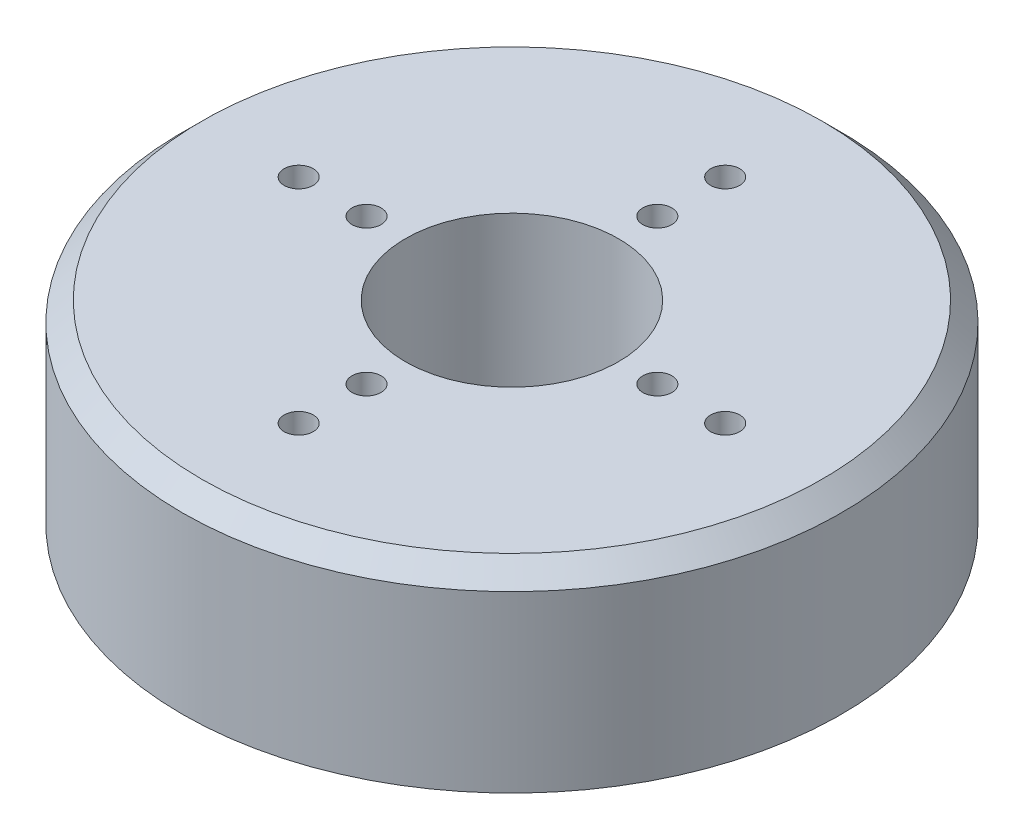
ISO-10303-21;
HEADER;
FILE_DESCRIPTION(('STEP AP214'),'2;1');
FILE_NAME('part.step','',(''),(''),'','','');
FILE_SCHEMA(('AUTOMOTIVE_DESIGN { 1 0 10303 214 1 1 1 1 }'));
ENDSEC;
DATA;
#1=APPLICATION_CONTEXT('core data for automotive mechanical design processes');
#2=APPLICATION_PROTOCOL_DEFINITION('international standard','automotive_design',2000,#1);
#3=PRODUCT_CONTEXT('',#1,'mechanical');
#4=PRODUCT('Part','Part','',(#3));
#5=PRODUCT_RELATED_PRODUCT_CATEGORY('part','',(#4));
#6=PRODUCT_DEFINITION_FORMATION('','',#4);
#7=PRODUCT_DEFINITION_CONTEXT('part definition',#1,'design');
#8=PRODUCT_DEFINITION('design','',#6,#7);
#9=PRODUCT_DEFINITION_SHAPE('','',#8);
#10=(LENGTH_UNIT() NAMED_UNIT(*) SI_UNIT(.MILLI.,.METRE.));
#11=(NAMED_UNIT(*) PLANE_ANGLE_UNIT() SI_UNIT($,.RADIAN.));
#12=(NAMED_UNIT(*) SI_UNIT($,.STERADIAN.) SOLID_ANGLE_UNIT());
#13=UNCERTAINTY_MEASURE_WITH_UNIT(LENGTH_MEASURE(1.E-05),#10,'distance_accuracy_value','');
#14=(GEOMETRIC_REPRESENTATION_CONTEXT(3) GLOBAL_UNCERTAINTY_ASSIGNED_CONTEXT((#13)) GLOBAL_UNIT_ASSIGNED_CONTEXT((#10,
#11,#12)) REPRESENTATION_CONTEXT('',''));
#15=CARTESIAN_POINT('',(0.,0.,0.));
#16=DIRECTION('',(0.,0.,1.));
#17=DIRECTION('',(1.,0.,0.));
#18=AXIS2_PLACEMENT_3D('',#15,#16,#17);
#19=CARTESIAN_POINT('',(0.,20.,0.));
#20=DIRECTION('',(0.,-1.,0.));
#21=DIRECTION('',(0.,0.,-1.));
#22=AXIS2_PLACEMENT_3D('',#19,#20,#21);
#23=CYLINDRICAL_SURFACE('',#22,30.);
#24=CARTESIAN_POINT('',(0.,16.,0.));
#25=DIRECTION('',(0.,1.,0.));
#26=DIRECTION('',(0.,0.,1.));
#27=AXIS2_PLACEMENT_3D('',#24,#25,#26);
#28=CIRCLE('',#27,30.);
#29=CARTESIAN_POINT('',(0.,16.,30.));
#30=VERTEX_POINT('',#29);
#31=EDGE_CURVE('E63',#30,#30,#28,.T.);
#32=ORIENTED_EDGE('',*,*,#31,.T.);
#33=EDGE_LOOP('',(#32));
#34=FACE_BOUND('',#33,.T.);
#35=CARTESIAN_POINT('',(0.,13.,0.));
#36=DIRECTION('',(0.,-1.,0.));
#37=DIRECTION('',(0.,0.,-1.));
#38=AXIS2_PLACEMENT_3D('',#35,#36,#37);
#39=CIRCLE('',#38,30.);
#40=CARTESIAN_POINT('',(0.,13.,-30.));
#41=VERTEX_POINT('',#40);
#42=EDGE_CURVE('E129',#41,#41,#39,.T.);
#43=ORIENTED_EDGE('',*,*,#42,.T.);
#44=EDGE_LOOP('',(#43));
#45=FACE_BOUND('',#44,.T.);
#46=ADVANCED_FACE('F36',(#34,#45),#23,.F.);
#47=CARTESIAN_POINT('',(0.,-35.3553390593274,0.));
#48=DIRECTION('',(0.,1.,0.));
#49=DIRECTION('',(0.,0.,1.));
#50=AXIS2_PLACEMENT_3D('',#47,#48,#49);
#51=CYLINDRICAL_SURFACE('',#50,12.5);
#52=CARTESIAN_POINT('',(0.,16.,0.));
#53=DIRECTION('',(0.,1.,0.));
#54=DIRECTION('',(0.,0.,1.));
#55=AXIS2_PLACEMENT_3D('',#52,#53,#54);
#56=CIRCLE('',#55,12.5);
#57=CARTESIAN_POINT('',(0.,16.,12.5));
#58=VERTEX_POINT('',#57);
#59=EDGE_CURVE('E47',#58,#58,#56,.F.);
#60=ORIENTED_EDGE('',*,*,#59,.T.);
#61=EDGE_LOOP('',(#60));
#62=FACE_BOUND('',#61,.T.);
#63=CARTESIAN_POINT('',(0.,13.,0.));
#64=DIRECTION('',(0.,-1.,0.));
#65=DIRECTION('',(0.,0.,-1.));
#66=AXIS2_PLACEMENT_3D('',#63,#64,#65);
#67=CIRCLE('',#66,12.5);
#68=CARTESIAN_POINT('',(0.,13.,-12.5));
#69=VERTEX_POINT('',#68);
#70=EDGE_CURVE('E43',#69,#69,#67,.T.);
#71=ORIENTED_EDGE('',*,*,#70,.F.);
#72=EDGE_LOOP('',(#71));
#73=FACE_BOUND('',#72,.T.);
#74=ADVANCED_FACE('F152',(#62,#73),#51,.T.);
#75=CARTESIAN_POINT('',(0.,16.,0.));
#76=DIRECTION('',(0.,1.,0.));
#77=DIRECTION('',(0.,0.,1.));
#78=AXIS2_PLACEMENT_3D('',#75,#76,#77);
#79=PLANE('',#78);
#80=ORIENTED_EDGE('',*,*,#31,.F.);
#81=EDGE_LOOP('',(#80));
#82=FACE_BOUND('',#81,.T.);
#83=CARTESIAN_POINT('',(-22.,16.,0.));
#84=DIRECTION('',(0.,1.,0.));
#85=DIRECTION('',(0.,0.,1.));
#86=AXIS2_PLACEMENT_3D('',#83,#84,#85);
#87=CIRCLE('',#86,1.5);
#88=CARTESIAN_POINT('',(-22.,16.,1.50000000000001));
#89=VERTEX_POINT('',#88);
#90=EDGE_CURVE('E82',#89,#89,#87,.T.);
#91=ORIENTED_EDGE('',*,*,#90,.T.);
#92=EDGE_LOOP('',(#91));
#93=FACE_BOUND('',#92,.T.);
#94=CARTESIAN_POINT('',(-15.,16.,0.));
#95=DIRECTION('',(0.,1.,0.));
#96=DIRECTION('',(0.,0.,1.));
#97=AXIS2_PLACEMENT_3D('',#94,#95,#96);
#98=CIRCLE('',#97,1.5);
#99=CARTESIAN_POINT('',(-15.,16.,1.5));
#100=VERTEX_POINT('',#99);
#101=EDGE_CURVE('E79',#100,#100,#98,.T.);
#102=ORIENTED_EDGE('',*,*,#101,.T.);
#103=EDGE_LOOP('',(#102));
#104=FACE_BOUND('',#103,.T.);
#105=CARTESIAN_POINT('',(0.,16.,22.));
#106=DIRECTION('',(0.,1.,0.));
#107=DIRECTION('',(0.,0.,1.));
#108=AXIS2_PLACEMENT_3D('',#105,#106,#107);
#109=CIRCLE('',#108,1.5);
#110=CARTESIAN_POINT('',(0.,16.,23.5));
#111=VERTEX_POINT('',#110);
#112=EDGE_CURVE('E76',#111,#111,#109,.T.);
#113=ORIENTED_EDGE('',*,*,#112,.T.);
#114=EDGE_LOOP('',(#113));
#115=FACE_BOUND('',#114,.T.);
#116=CARTESIAN_POINT('',(0.,16.,15.));
#117=DIRECTION('',(0.,1.,0.));
#118=DIRECTION('',(0.,0.,1.));
#119=AXIS2_PLACEMENT_3D('',#116,#117,#118);
#120=CIRCLE('',#119,1.5);
#121=CARTESIAN_POINT('',(0.,16.,16.5));
#122=VERTEX_POINT('',#121);
#123=EDGE_CURVE('E73',#122,#122,#120,.T.);
#124=ORIENTED_EDGE('',*,*,#123,.T.);
#125=EDGE_LOOP('',(#124));
#126=FACE_BOUND('',#125,.T.);
#127=CARTESIAN_POINT('',(22.,16.,0.));
#128=DIRECTION('',(0.,1.,0.));
#129=DIRECTION('',(0.,0.,1.));
#130=AXIS2_PLACEMENT_3D('',#127,#128,#129);
#131=CIRCLE('',#130,1.5);
#132=CARTESIAN_POINT('',(22.,16.,1.5));
#133=VERTEX_POINT('',#132);
#134=EDGE_CURVE('E70',#133,#133,#131,.T.);
#135=ORIENTED_EDGE('',*,*,#134,.T.);
#136=EDGE_LOOP('',(#135));
#137=FACE_BOUND('',#136,.T.);
#138=CARTESIAN_POINT('',(15.,16.,0.));
#139=DIRECTION('',(0.,1.,0.));
#140=DIRECTION('',(0.,0.,1.));
#141=AXIS2_PLACEMENT_3D('',#138,#139,#140);
#142=CIRCLE('',#141,1.5);
#143=CARTESIAN_POINT('',(15.,16.,1.5));
#144=VERTEX_POINT('',#143);
#145=EDGE_CURVE('E67',#144,#144,#142,.T.);
#146=ORIENTED_EDGE('',*,*,#145,.T.);
#147=EDGE_LOOP('',(#146));
#148=FACE_BOUND('',#147,.T.);
#149=CARTESIAN_POINT('',(0.,16.,-22.));
#150=DIRECTION('',(0.,1.,0.));
#151=DIRECTION('',(0.,0.,1.));
#152=AXIS2_PLACEMENT_3D('',#149,#150,#151);
#153=CIRCLE('',#152,1.5);
#154=CARTESIAN_POINT('',(0.,16.,-20.5));
#155=VERTEX_POINT('',#154);
#156=EDGE_CURVE('E64',#155,#155,#153,.T.);
#157=ORIENTED_EDGE('',*,*,#156,.T.);
#158=EDGE_LOOP('',(#157));
#159=FACE_BOUND('',#158,.T.);
#160=CARTESIAN_POINT('',(0.,16.,-15.));
#161=DIRECTION('',(0.,1.,0.));
#162=DIRECTION('',(0.,0.,1.));
#163=AXIS2_PLACEMENT_3D('',#160,#161,#162);
#164=CIRCLE('',#163,1.5);
#165=CARTESIAN_POINT('',(0.,16.,-13.5));
#166=VERTEX_POINT('',#165);
#167=EDGE_CURVE('E60',#166,#166,#164,.T.);
#168=ORIENTED_EDGE('',*,*,#167,.T.);
#169=EDGE_LOOP('',(#168));
#170=FACE_BOUND('',#169,.T.);
#171=ORIENTED_EDGE('',*,*,#59,.F.);
#172=EDGE_LOOP('',(#171));
#173=FACE_BOUND('',#172,.T.);
#174=ADVANCED_FACE('F159',(#82,#93,#104,#115,#126,#137,#148,#159,#170,#173),#79,.F.);
#175=CARTESIAN_POINT('',(0.,10.,0.));
#176=DIRECTION('',(0.,-1.,0.));
#177=DIRECTION('',(0.,0.,-1.));
#178=AXIS2_PLACEMENT_3D('',#175,#176,#177);
#179=CIRCLE('',#178,30.);
#180=CARTESIAN_POINT('',(0.,10.,-30.));
#181=VERTEX_POINT('',#180);
#182=EDGE_CURVE('E10',#181,#181,#179,.T.);
#183=ORIENTED_EDGE('',*,*,#182,.F.);
#184=EDGE_LOOP('',(#183));
#185=FACE_BOUND('',#184,.T.);
#186=CARTESIAN_POINT('',(0.,0.,0.));
#187=DIRECTION('',(0.,1.,0.));
#188=DIRECTION('',(0.,0.,1.));
#189=AXIS2_PLACEMENT_3D('',#186,#187,#188);
#190=CIRCLE('',#189,30.);
#191=CARTESIAN_POINT('',(0.,0.,30.));
#192=VERTEX_POINT('',#191);
#193=EDGE_CURVE('E88',#192,#192,#190,.T.);
#194=ORIENTED_EDGE('',*,*,#193,.F.);
#195=EDGE_LOOP('',(#194));
#196=FACE_BOUND('',#195,.T.);
#197=ADVANCED_FACE('F155',(#185,#196),#23,.F.);
#198=CARTESIAN_POINT('',(0.,20.,0.));
#199=DIRECTION('',(0.,1.,0.));
#200=DIRECTION('',(0.,0.,1.));
#201=AXIS2_PLACEMENT_3D('',#198,#199,#200);
#202=PLANE('',#201);
#203=CARTESIAN_POINT('',(0.,20.,0.));
#204=DIRECTION('',(0.,1.,0.));
#205=DIRECTION('',(0.,0.,1.));
#206=AXIS2_PLACEMENT_3D('',#203,#204,#205);
#207=CIRCLE('',#206,32.);
#208=CARTESIAN_POINT('',(0.,20.,32.));
#209=VERTEX_POINT('',#208);
#210=EDGE_CURVE('E56',#209,#209,#207,.T.);
#211=ORIENTED_EDGE('',*,*,#210,.T.);
#212=EDGE_LOOP('',(#211));
#213=FACE_BOUND('',#212,.T.);
#214=CARTESIAN_POINT('',(0.,20.,-15.));
#215=DIRECTION('',(0.,1.,0.));
#216=DIRECTION('',(0.,0.,1.));
#217=AXIS2_PLACEMENT_3D('',#214,#215,#216);
#218=CIRCLE('',#217,1.5);
#219=CARTESIAN_POINT('',(0.,20.,-13.5));
#220=VERTEX_POINT('',#219);
#221=EDGE_CURVE('E95',#220,#220,#218,.T.);
#222=ORIENTED_EDGE('',*,*,#221,.F.);
#223=EDGE_LOOP('',(#222));
#224=FACE_BOUND('',#223,.T.);
#225=CARTESIAN_POINT('',(0.,20.,-22.));
#226=DIRECTION('',(0.,1.,0.));
#227=DIRECTION('',(0.,0.,1.));
#228=AXIS2_PLACEMENT_3D('',#225,#226,#227);
#229=CIRCLE('',#228,1.5);
#230=CARTESIAN_POINT('',(0.,20.,-20.5));
#231=VERTEX_POINT('',#230);
#232=EDGE_CURVE('E103',#231,#231,#229,.T.);
#233=ORIENTED_EDGE('',*,*,#232,.F.);
#234=EDGE_LOOP('',(#233));
#235=FACE_BOUND('',#234,.T.);
#236=CARTESIAN_POINT('',(15.,20.,0.));
#237=DIRECTION('',(0.,1.,0.));
#238=DIRECTION('',(0.,0.,1.));
#239=AXIS2_PLACEMENT_3D('',#236,#237,#238);
#240=CIRCLE('',#239,1.5);
#241=CARTESIAN_POINT('',(15.,20.,1.5));
#242=VERTEX_POINT('',#241);
#243=EDGE_CURVE('E99',#242,#242,#240,.T.);
#244=ORIENTED_EDGE('',*,*,#243,.F.);
#245=EDGE_LOOP('',(#244));
#246=FACE_BOUND('',#245,.T.);
#247=CARTESIAN_POINT('',(22.,20.,0.));
#248=DIRECTION('',(0.,1.,0.));
#249=DIRECTION('',(0.,0.,1.));
#250=AXIS2_PLACEMENT_3D('',#247,#248,#249);
#251=CIRCLE('',#250,1.5);
#252=CARTESIAN_POINT('',(22.,20.,1.5));
#253=VERTEX_POINT('',#252);
#254=EDGE_CURVE('E96',#253,#253,#251,.T.);
#255=ORIENTED_EDGE('',*,*,#254,.F.);
#256=EDGE_LOOP('',(#255));
#257=FACE_BOUND('',#256,.T.);
#258=CARTESIAN_POINT('',(0.,20.,15.));
#259=DIRECTION('',(0.,1.,0.));
#260=DIRECTION('',(0.,0.,1.));
#261=AXIS2_PLACEMENT_3D('',#258,#259,#260);
#262=CIRCLE('',#261,1.5);
#263=CARTESIAN_POINT('',(0.,20.,16.5));
#264=VERTEX_POINT('',#263);
#265=EDGE_CURVE('E100',#264,#264,#262,.T.);
#266=ORIENTED_EDGE('',*,*,#265,.F.);
#267=EDGE_LOOP('',(#266));
#268=FACE_BOUND('',#267,.T.);
#269=CARTESIAN_POINT('',(0.,20.,22.));
#270=DIRECTION('',(0.,1.,0.));
#271=DIRECTION('',(0.,0.,1.));
#272=AXIS2_PLACEMENT_3D('',#269,#270,#271);
#273=CIRCLE('',#272,1.5);
#274=CARTESIAN_POINT('',(0.,20.,23.5));
#275=VERTEX_POINT('',#274);
#276=EDGE_CURVE('E115',#275,#275,#273,.T.);
#277=ORIENTED_EDGE('',*,*,#276,.F.);
#278=EDGE_LOOP('',(#277));
#279=FACE_BOUND('',#278,.T.);
#280=CARTESIAN_POINT('',(-15.,20.,0.));
#281=DIRECTION('',(0.,1.,0.));
#282=DIRECTION('',(0.,0.,1.));
#283=AXIS2_PLACEMENT_3D('',#280,#281,#282);
#284=CIRCLE('',#283,1.5);
#285=CARTESIAN_POINT('',(-15.,20.,1.5));
#286=VERTEX_POINT('',#285);
#287=EDGE_CURVE('E111',#286,#286,#284,.T.);
#288=ORIENTED_EDGE('',*,*,#287,.F.);
#289=EDGE_LOOP('',(#288));
#290=FACE_BOUND('',#289,.T.);
#291=CARTESIAN_POINT('',(-22.,20.,0.));
#292=DIRECTION('',(0.,1.,0.));
#293=DIRECTION('',(0.,0.,1.));
#294=AXIS2_PLACEMENT_3D('',#291,#292,#293);
#295=CIRCLE('',#294,1.5);
#296=CARTESIAN_POINT('',(-22.,20.,1.50000000000001));
#297=VERTEX_POINT('',#296);
#298=EDGE_CURVE('E108',#297,#297,#295,.T.);
#299=ORIENTED_EDGE('',*,*,#298,.F.);
#300=EDGE_LOOP('',(#299));
#301=FACE_BOUND('',#300,.T.);
#302=CARTESIAN_POINT('',(0.,20.,0.));
#303=DIRECTION('',(0.,1.,0.));
#304=DIRECTION('',(0.,0.,1.));
#305=AXIS2_PLACEMENT_3D('',#302,#303,#304);
#306=CIRCLE('',#305,11.);
#307=CARTESIAN_POINT('',(0.,20.,11.));
#308=VERTEX_POINT('',#307);
#309=EDGE_CURVE('E85',#308,#308,#306,.T.);
#310=ORIENTED_EDGE('',*,*,#309,.F.);
#311=EDGE_LOOP('',(#310));
#312=FACE_BOUND('',#311,.T.);
#313=ADVANCED_FACE('F166',(#213,#224,#235,#246,#257,#268,#279,#290,#301,#312),#202,.T.);
#314=CARTESIAN_POINT('',(0.,0.,0.));
#315=DIRECTION('',(0.,1.,0.));
#316=DIRECTION('',(0.,0.,1.));
#317=AXIS2_PLACEMENT_3D('',#314,#315,#316);
#318=PLANE('',#317);
#319=CARTESIAN_POINT('',(0.,0.,0.));
#320=DIRECTION('',(0.,1.,0.));
#321=DIRECTION('',(0.,0.,1.));
#322=AXIS2_PLACEMENT_3D('',#319,#320,#321);
#323=CIRCLE('',#322,34.);
#324=CARTESIAN_POINT('',(0.,0.,34.));
#325=VERTEX_POINT('',#324);
#326=EDGE_CURVE('E59',#325,#325,#323,.T.);
#327=ORIENTED_EDGE('',*,*,#326,.F.);
#328=EDGE_LOOP('',(#327));
#329=FACE_BOUND('',#328,.T.);
#330=ORIENTED_EDGE('',*,*,#193,.T.);
#331=EDGE_LOOP('',(#330));
#332=FACE_BOUND('',#331,.T.);
#333=ADVANCED_FACE('F172',(#329,#332),#318,.F.);
#334=CARTESIAN_POINT('',(0.,20.,0.));
#335=DIRECTION('',(0.,-1.,0.));
#336=DIRECTION('',(0.,0.,-1.));
#337=AXIS2_PLACEMENT_3D('',#334,#335,#336);
#338=CYLINDRICAL_SURFACE('',#337,34.);
#339=CARTESIAN_POINT('',(0.,18.,0.));
#340=DIRECTION('',(0.,1.,0.));
#341=DIRECTION('',(0.,0.,1.));
#342=AXIS2_PLACEMENT_3D('',#339,#340,#341);
#343=CIRCLE('',#342,34.);
#344=CARTESIAN_POINT('',(0.,18.,34.));
#345=VERTEX_POINT('',#344);
#346=EDGE_CURVE('E51',#345,#345,#343,.F.);
#347=ORIENTED_EDGE('',*,*,#346,.T.);
#348=EDGE_LOOP('',(#347));
#349=FACE_BOUND('',#348,.T.);
#350=ORIENTED_EDGE('',*,*,#326,.T.);
#351=EDGE_LOOP('',(#350));
#352=FACE_BOUND('',#351,.T.);
#353=ADVANCED_FACE('F179',(#349,#352),#338,.T.);
#354=CARTESIAN_POINT('',(0.,0.,0.));
#355=DIRECTION('',(0.,1.,0.));
#356=DIRECTION('',(0.,0.,1.));
#357=AXIS2_PLACEMENT_3D('',#354,#355,#356);
#358=CYLINDRICAL_SURFACE('',#357,11.);
#359=CARTESIAN_POINT('',(0.,3.,0.));
#360=DIRECTION('',(0.,1.,0.));
#361=DIRECTION('',(0.,0.,1.));
#362=AXIS2_PLACEMENT_3D('',#359,#360,#361);
#363=CIRCLE('',#362,11.);
#364=CARTESIAN_POINT('',(0.,3.,11.));
#365=VERTEX_POINT('',#364);
#366=EDGE_CURVE('E122',#365,#365,#363,.F.);
#367=ORIENTED_EDGE('',*,*,#366,.T.);
#368=EDGE_LOOP('',(#367));
#369=FACE_BOUND('',#368,.T.);
#370=ORIENTED_EDGE('',*,*,#309,.T.);
#371=EDGE_LOOP('',(#370));
#372=FACE_BOUND('',#371,.T.);
#373=ADVANCED_FACE('F185',(#369,#372),#358,.F.);
#374=CARTESIAN_POINT('',(-22.,0.,0.));
#375=DIRECTION('',(0.,1.,0.));
#376=DIRECTION('',(0.,0.,1.));
#377=AXIS2_PLACEMENT_3D('',#374,#375,#376);
#378=CYLINDRICAL_SURFACE('',#377,1.5);
#379=ORIENTED_EDGE('',*,*,#298,.T.);
#380=EDGE_LOOP('',(#379));
#381=FACE_BOUND('',#380,.T.);
#382=ORIENTED_EDGE('',*,*,#90,.F.);
#383=EDGE_LOOP('',(#382));
#384=FACE_BOUND('',#383,.T.);
#385=ADVANCED_FACE('F192',(#381,#384),#378,.F.);
#386=CARTESIAN_POINT('',(-15.,0.,0.));
#387=DIRECTION('',(0.,1.,0.));
#388=DIRECTION('',(0.,0.,1.));
#389=AXIS2_PLACEMENT_3D('',#386,#387,#388);
#390=CYLINDRICAL_SURFACE('',#389,1.5);
#391=ORIENTED_EDGE('',*,*,#287,.T.);
#392=EDGE_LOOP('',(#391));
#393=FACE_BOUND('',#392,.T.);
#394=ORIENTED_EDGE('',*,*,#101,.F.);
#395=EDGE_LOOP('',(#394));
#396=FACE_BOUND('',#395,.T.);
#397=ADVANCED_FACE('F223',(#393,#396),#390,.F.);
#398=CARTESIAN_POINT('',(0.,0.,22.));
#399=DIRECTION('',(0.,1.,0.));
#400=DIRECTION('',(0.,0.,1.));
#401=AXIS2_PLACEMENT_3D('',#398,#399,#400);
#402=CYLINDRICAL_SURFACE('',#401,1.5);
#403=ORIENTED_EDGE('',*,*,#276,.T.);
#404=EDGE_LOOP('',(#403));
#405=FACE_BOUND('',#404,.T.);
#406=ORIENTED_EDGE('',*,*,#112,.F.);
#407=EDGE_LOOP('',(#406));
#408=FACE_BOUND('',#407,.T.);
#409=ADVANCED_FACE('F267',(#405,#408),#402,.F.);
#410=CARTESIAN_POINT('',(0.,0.,15.));
#411=DIRECTION('',(0.,1.,0.));
#412=DIRECTION('',(0.,0.,1.));
#413=AXIS2_PLACEMENT_3D('',#410,#411,#412);
#414=CYLINDRICAL_SURFACE('',#413,1.5);
#415=ORIENTED_EDGE('',*,*,#265,.T.);
#416=EDGE_LOOP('',(#415));
#417=FACE_BOUND('',#416,.T.);
#418=ORIENTED_EDGE('',*,*,#123,.F.);
#419=EDGE_LOOP('',(#418));
#420=FACE_BOUND('',#419,.T.);
#421=ADVANCED_FACE('F262',(#417,#420),#414,.F.);
#422=CARTESIAN_POINT('',(22.,0.,0.));
#423=DIRECTION('',(0.,1.,0.));
#424=DIRECTION('',(0.,0.,1.));
#425=AXIS2_PLACEMENT_3D('',#422,#423,#424);
#426=CYLINDRICAL_SURFACE('',#425,1.5);
#427=ORIENTED_EDGE('',*,*,#254,.T.);
#428=EDGE_LOOP('',(#427));
#429=FACE_BOUND('',#428,.T.);
#430=ORIENTED_EDGE('',*,*,#134,.F.);
#431=EDGE_LOOP('',(#430));
#432=FACE_BOUND('',#431,.T.);
#433=ADVANCED_FACE('F259',(#429,#432),#426,.F.);
#434=CARTESIAN_POINT('',(15.,0.,0.));
#435=DIRECTION('',(0.,1.,0.));
#436=DIRECTION('',(0.,0.,1.));
#437=AXIS2_PLACEMENT_3D('',#434,#435,#436);
#438=CYLINDRICAL_SURFACE('',#437,1.5);
#439=ORIENTED_EDGE('',*,*,#243,.T.);
#440=EDGE_LOOP('',(#439));
#441=FACE_BOUND('',#440,.T.);
#442=ORIENTED_EDGE('',*,*,#145,.F.);
#443=EDGE_LOOP('',(#442));
#444=FACE_BOUND('',#443,.T.);
#445=ADVANCED_FACE('F252',(#441,#444),#438,.F.);
#446=CARTESIAN_POINT('',(0.,0.,-22.));
#447=DIRECTION('',(0.,1.,0.));
#448=DIRECTION('',(0.,0.,1.));
#449=AXIS2_PLACEMENT_3D('',#446,#447,#448);
#450=CYLINDRICAL_SURFACE('',#449,1.5);
#451=ORIENTED_EDGE('',*,*,#232,.T.);
#452=EDGE_LOOP('',(#451));
#453=FACE_BOUND('',#452,.T.);
#454=ORIENTED_EDGE('',*,*,#156,.F.);
#455=EDGE_LOOP('',(#454));
#456=FACE_BOUND('',#455,.T.);
#457=ADVANCED_FACE('F246',(#453,#456),#450,.F.);
#458=CARTESIAN_POINT('',(0.,0.,-15.));
#459=DIRECTION('',(0.,1.,0.));
#460=DIRECTION('',(0.,0.,1.));
#461=AXIS2_PLACEMENT_3D('',#458,#459,#460);
#462=CYLINDRICAL_SURFACE('',#461,1.5);
#463=ORIENTED_EDGE('',*,*,#221,.T.);
#464=EDGE_LOOP('',(#463));
#465=FACE_BOUND('',#464,.T.);
#466=ORIENTED_EDGE('',*,*,#167,.F.);
#467=EDGE_LOOP('',(#466));
#468=FACE_BOUND('',#467,.T.);
#469=ADVANCED_FACE('F199',(#465,#468),#462,.F.);
#470=CARTESIAN_POINT('',(0.,20.,0.));
#471=DIRECTION('',(0.,-1.,0.));
#472=DIRECTION('',(0.,0.,-1.));
#473=AXIS2_PLACEMENT_3D('',#470,#471,#472);
#474=CONICAL_SURFACE('',#473,32.,0.785398163397447);
#475=ORIENTED_EDGE('',*,*,#346,.F.);
#476=EDGE_LOOP('',(#475));
#477=FACE_BOUND('',#476,.T.);
#478=ORIENTED_EDGE('',*,*,#210,.F.);
#479=EDGE_LOOP('',(#478));
#480=FACE_BOUND('',#479,.T.);
#481=ADVANCED_FACE('F38',(#477,#480),#474,.T.);
#482=CARTESIAN_POINT('',(0.,10.,0.));
#483=DIRECTION('',(0.,-1.,0.));
#484=DIRECTION('',(0.,0.,-1.));
#485=AXIS2_PLACEMENT_3D('',#482,#483,#484);
#486=CIRCLE('',#485,12.5);
#487=CARTESIAN_POINT('',(0.,10.,-12.5));
#488=VERTEX_POINT('',#487);
#489=EDGE_CURVE('E134',#488,#488,#486,.T.);
#490=ORIENTED_EDGE('',*,*,#489,.T.);
#491=EDGE_LOOP('',(#490));
#492=FACE_BOUND('',#491,.T.);
#493=CARTESIAN_POINT('',(0.,0.,0.));
#494=DIRECTION('',(0.,1.,0.));
#495=DIRECTION('',(0.,0.,1.));
#496=AXIS2_PLACEMENT_3D('',#493,#494,#495);
#497=CIRCLE('',#496,12.5);
#498=CARTESIAN_POINT('',(0.,0.,12.5));
#499=VERTEX_POINT('',#498);
#500=EDGE_CURVE('E112',#499,#499,#497,.T.);
#501=ORIENTED_EDGE('',*,*,#500,.T.);
#502=EDGE_LOOP('',(#501));
#503=FACE_BOUND('',#502,.T.);
#504=ADVANCED_FACE('F138',(#492,#503),#51,.T.);
#505=CARTESIAN_POINT('',(0.,0.,0.));
#506=DIRECTION('',(0.,1.,0.));
#507=DIRECTION('',(0.,0.,1.));
#508=AXIS2_PLACEMENT_3D('',#505,#506,#507);
#509=PLANE('',#508);
#510=CARTESIAN_POINT('',(0.,0.,0.));
#511=DIRECTION('',(0.,1.,0.));
#512=DIRECTION('',(0.,0.,1.));
#513=AXIS2_PLACEMENT_3D('',#510,#511,#512);
#514=CIRCLE('',#513,2.5);
#515=CARTESIAN_POINT('',(0.,0.,2.5));
#516=VERTEX_POINT('',#515);
#517=EDGE_CURVE('E125',#516,#516,#514,.T.);
#518=ORIENTED_EDGE('',*,*,#517,.T.);
#519=EDGE_LOOP('',(#518));
#520=FACE_BOUND('',#519,.T.);
#521=ORIENTED_EDGE('',*,*,#500,.F.);
#522=EDGE_LOOP('',(#521));
#523=FACE_BOUND('',#522,.T.);
#524=ADVANCED_FACE('F278',(#520,#523),#509,.F.);
#525=CARTESIAN_POINT('',(0.,3.,0.));
#526=DIRECTION('',(0.,1.,0.));
#527=DIRECTION('',(0.,0.,1.));
#528=AXIS2_PLACEMENT_3D('',#525,#526,#527);
#529=PLANE('',#528);
#530=CARTESIAN_POINT('',(0.,3.,0.));
#531=DIRECTION('',(0.,1.,0.));
#532=DIRECTION('',(0.,0.,1.));
#533=AXIS2_PLACEMENT_3D('',#530,#531,#532);
#534=CIRCLE('',#533,2.5);
#535=CARTESIAN_POINT('',(0.,3.,2.5));
#536=VERTEX_POINT('',#535);
#537=EDGE_CURVE('E126',#536,#536,#534,.T.);
#538=ORIENTED_EDGE('',*,*,#537,.F.);
#539=EDGE_LOOP('',(#538));
#540=FACE_BOUND('',#539,.T.);
#541=ORIENTED_EDGE('',*,*,#366,.F.);
#542=EDGE_LOOP('',(#541));
#543=FACE_BOUND('',#542,.T.);
#544=ADVANCED_FACE('F357',(#540,#543),#529,.T.);
#545=CARTESIAN_POINT('',(0.,0.,0.));
#546=DIRECTION('',(0.,1.,0.));
#547=DIRECTION('',(0.,0.,1.));
#548=AXIS2_PLACEMENT_3D('',#545,#546,#547);
#549=CYLINDRICAL_SURFACE('',#548,2.5);
#550=ORIENTED_EDGE('',*,*,#517,.F.);
#551=EDGE_LOOP('',(#550));
#552=FACE_BOUND('',#551,.T.);
#553=ORIENTED_EDGE('',*,*,#537,.T.);
#554=EDGE_LOOP('',(#553));
#555=FACE_BOUND('',#554,.T.);
#556=ADVANCED_FACE('F148',(#552,#555),#549,.F.);
#557=CARTESIAN_POINT('',(0.,13.,0.));
#558=DIRECTION('',(0.,-1.,0.));
#559=DIRECTION('',(0.,0.,-1.));
#560=AXIS2_PLACEMENT_3D('',#557,#558,#559);
#561=PLANE('',#560);
#562=ORIENTED_EDGE('',*,*,#42,.F.);
#563=EDGE_LOOP('',(#562));
#564=FACE_BOUND('',#563,.T.);
#565=ORIENTED_EDGE('',*,*,#70,.T.);
#566=EDGE_LOOP('',(#565));
#567=FACE_BOUND('',#566,.T.);
#568=ADVANCED_FACE('F143',(#564,#567),#561,.F.);
#569=CARTESIAN_POINT('',(0.,10.,0.));
#570=DIRECTION('',(0.,-1.,0.));
#571=DIRECTION('',(0.,0.,-1.));
#572=AXIS2_PLACEMENT_3D('',#569,#570,#571);
#573=PLANE('',#572);
#574=ORIENTED_EDGE('',*,*,#182,.T.);
#575=EDGE_LOOP('',(#574));
#576=FACE_BOUND('',#575,.T.);
#577=ORIENTED_EDGE('',*,*,#489,.F.);
#578=EDGE_LOOP('',(#577));
#579=FACE_BOUND('',#578,.T.);
#580=ADVANCED_FACE('F141',(#576,#579),#573,.T.);
#581=CLOSED_SHELL('',(#46,#74,#174,#197,#313,#333,#353,#373,#385,#397,#409,#421,#433,#445,#457,
#469,#481,#504,#524,#544,#556,#568,#580));
#582=MANIFOLD_SOLID_BREP('B2',#581);
#583=ADVANCED_BREP_SHAPE_REPRESENTATION('',(#18,#582),#14);
#584=SHAPE_DEFINITION_REPRESENTATION(#9,#583);
ENDSEC;
END-ISO-10303-21;
